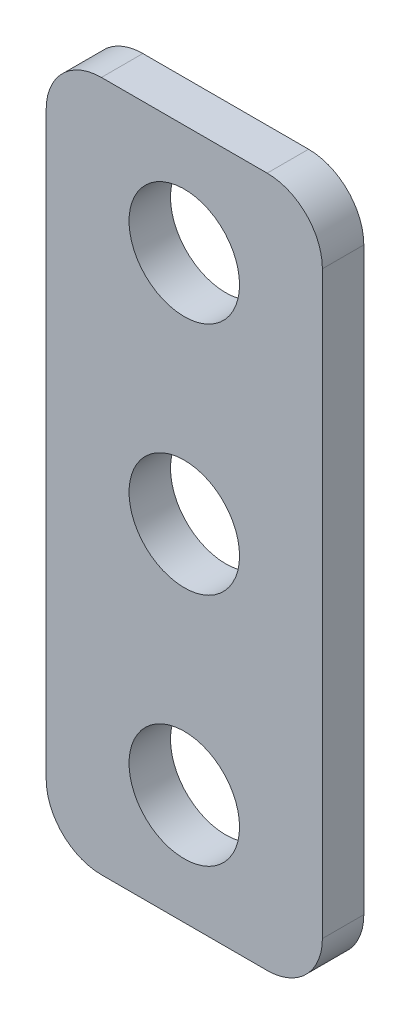
ISO-10303-21;
HEADER;
FILE_DESCRIPTION(('STEP AP214'),'2;1');
FILE_NAME('part.step','',(''),(''),'','','');
FILE_SCHEMA(('AUTOMOTIVE_DESIGN { 1 0 10303 214 1 1 1 1 }'));
ENDSEC;
DATA;
#1=APPLICATION_CONTEXT('core data for automotive mechanical design processes');
#2=APPLICATION_PROTOCOL_DEFINITION('international standard','automotive_design',2000,#1);
#3=PRODUCT_CONTEXT('',#1,'mechanical');
#4=PRODUCT('Part','Part','',(#3));
#5=PRODUCT_RELATED_PRODUCT_CATEGORY('part','',(#4));
#6=PRODUCT_DEFINITION_FORMATION('','',#4);
#7=PRODUCT_DEFINITION_CONTEXT('part definition',#1,'design');
#8=PRODUCT_DEFINITION('design','',#6,#7);
#9=PRODUCT_DEFINITION_SHAPE('','',#8);
#10=(LENGTH_UNIT() NAMED_UNIT(*) SI_UNIT(.MILLI.,.METRE.));
#11=(NAMED_UNIT(*) PLANE_ANGLE_UNIT() SI_UNIT($,.RADIAN.));
#12=(NAMED_UNIT(*) SI_UNIT($,.STERADIAN.) SOLID_ANGLE_UNIT());
#13=UNCERTAINTY_MEASURE_WITH_UNIT(LENGTH_MEASURE(1.E-05),#10,'distance_accuracy_value','');
#14=(GEOMETRIC_REPRESENTATION_CONTEXT(3) GLOBAL_UNCERTAINTY_ASSIGNED_CONTEXT((#13)) GLOBAL_UNIT_ASSIGNED_CONTEXT((#10,
#11,#12)) REPRESENTATION_CONTEXT('',''));
#15=CARTESIAN_POINT('',(0.,0.,0.));
#16=DIRECTION('',(0.,0.,1.));
#17=DIRECTION('',(1.,0.,0.));
#18=AXIS2_PLACEMENT_3D('',#15,#16,#17);
#19=CARTESIAN_POINT('',(9.99999999999999,-25.,-3.));
#20=DIRECTION('',(1.,0.,0.));
#21=DIRECTION('',(0.,0.,-1.));
#22=AXIS2_PLACEMENT_3D('',#19,#20,#21);
#23=PLANE('',#22);
#24=DIRECTION('',(0.,1.,0.));
#25=VECTOR('',#24,1.);
#26=CARTESIAN_POINT('',(9.99999999999999,-25.,0.));
#27=LINE('',#26,#25);
#28=CARTESIAN_POINT('',(9.99999999999999,-21.,0.));
#29=VERTEX_POINT('',#28);
#30=CARTESIAN_POINT('',(9.99999999999999,21.,0.));
#31=VERTEX_POINT('',#30);
#32=EDGE_CURVE('E167',#29,#31,#27,.T.);
#33=ORIENTED_EDGE('',*,*,#32,.F.);
#34=DIRECTION('',(0.,0.,1.));
#35=VECTOR('',#34,1.);
#36=CARTESIAN_POINT('',(9.99999999999999,-21.,-3.));
#37=LINE('',#36,#35);
#38=CARTESIAN_POINT('',(9.99999999999999,-21.,-3.));
#39=VERTEX_POINT('',#38);
#40=EDGE_CURVE('E147',#29,#39,#37,.F.);
#41=ORIENTED_EDGE('',*,*,#40,.T.);
#42=DIRECTION('',(0.,1.,0.));
#43=VECTOR('',#42,1.);
#44=CARTESIAN_POINT('',(9.99999999999999,-25.,-3.));
#45=LINE('',#44,#43);
#46=CARTESIAN_POINT('',(9.99999999999999,21.,-3.));
#47=VERTEX_POINT('',#46);
#48=EDGE_CURVE('E128',#39,#47,#45,.T.);
#49=ORIENTED_EDGE('',*,*,#48,.T.);
#50=DIRECTION('',(0.,0.,1.));
#51=VECTOR('',#50,1.);
#52=CARTESIAN_POINT('',(9.99999999999999,21.,-3.));
#53=LINE('',#52,#51);
#54=EDGE_CURVE('E144',#47,#31,#53,.T.);
#55=ORIENTED_EDGE('',*,*,#54,.T.);
#56=EDGE_LOOP('',(#33,#41,#49,#55));
#57=FACE_BOUND('',#56,.T.);
#58=ADVANCED_FACE('F41',(#57),#23,.T.);
#59=CARTESIAN_POINT('',(-10.,-25.,-3.));
#60=DIRECTION('',(0.,-1.,0.));
#61=DIRECTION('',(0.,0.,-1.));
#62=AXIS2_PLACEMENT_3D('',#59,#60,#61);
#63=PLANE('',#62);
#64=DIRECTION('',(1.,0.,0.));
#65=VECTOR('',#64,1.);
#66=CARTESIAN_POINT('',(-10.,-25.,-3.));
#67=LINE('',#66,#65);
#68=CARTESIAN_POINT('',(-6.00000000000001,-25.,-3.));
#69=VERTEX_POINT('',#68);
#70=CARTESIAN_POINT('',(5.99999999999999,-25.,-3.));
#71=VERTEX_POINT('',#70);
#72=EDGE_CURVE('E133',#69,#71,#67,.T.);
#73=ORIENTED_EDGE('',*,*,#72,.T.);
#74=DIRECTION('',(0.,0.,1.));
#75=VECTOR('',#74,1.);
#76=CARTESIAN_POINT('',(5.99999999999999,-25.,-3.));
#77=LINE('',#76,#75);
#78=CARTESIAN_POINT('',(5.99999999999999,-25.,0.));
#79=VERTEX_POINT('',#78);
#80=EDGE_CURVE('E127',#71,#79,#77,.T.);
#81=ORIENTED_EDGE('',*,*,#80,.T.);
#82=DIRECTION('',(1.,0.,0.));
#83=VECTOR('',#82,1.);
#84=CARTESIAN_POINT('',(-10.,-25.,0.));
#85=LINE('',#84,#83);
#86=CARTESIAN_POINT('',(-6.00000000000001,-25.,0.));
#87=VERTEX_POINT('',#86);
#88=EDGE_CURVE('E110',#87,#79,#85,.T.);
#89=ORIENTED_EDGE('',*,*,#88,.F.);
#90=DIRECTION('',(0.,0.,1.));
#91=VECTOR('',#90,1.);
#92=CARTESIAN_POINT('',(-6.00000000000001,-25.,-3.));
#93=LINE('',#92,#91);
#94=EDGE_CURVE('E124',#87,#69,#93,.F.);
#95=ORIENTED_EDGE('',*,*,#94,.T.);
#96=EDGE_LOOP('',(#73,#81,#89,#95));
#97=FACE_BOUND('',#96,.T.);
#98=ADVANCED_FACE('F123',(#97),#63,.T.);
#99=CARTESIAN_POINT('',(-10.,-25.,-3.));
#100=DIRECTION('',(-1.,0.,0.));
#101=DIRECTION('',(0.,0.,1.));
#102=AXIS2_PLACEMENT_3D('',#99,#100,#101);
#103=PLANE('',#102);
#104=DIRECTION('',(0.,-1.,0.));
#105=VECTOR('',#104,1.);
#106=CARTESIAN_POINT('',(-10.,-25.,-3.));
#107=LINE('',#106,#105);
#108=CARTESIAN_POINT('',(-10.,21.,-3.));
#109=VERTEX_POINT('',#108);
#110=CARTESIAN_POINT('',(-10.,-21.,-3.));
#111=VERTEX_POINT('',#110);
#112=EDGE_CURVE('E137',#109,#111,#107,.T.);
#113=ORIENTED_EDGE('',*,*,#112,.T.);
#114=DIRECTION('',(0.,0.,1.));
#115=VECTOR('',#114,1.);
#116=CARTESIAN_POINT('',(-10.,-21.,-3.));
#117=LINE('',#116,#115);
#118=CARTESIAN_POINT('',(-10.,-21.,0.));
#119=VERTEX_POINT('',#118);
#120=EDGE_CURVE('E157',#111,#119,#117,.T.);
#121=ORIENTED_EDGE('',*,*,#120,.T.);
#122=DIRECTION('',(0.,-1.,0.));
#123=VECTOR('',#122,1.);
#124=CARTESIAN_POINT('',(-10.,-25.,0.));
#125=LINE('',#124,#123);
#126=CARTESIAN_POINT('',(-10.,21.,0.));
#127=VERTEX_POINT('',#126);
#128=EDGE_CURVE('E112',#127,#119,#125,.T.);
#129=ORIENTED_EDGE('',*,*,#128,.F.);
#130=DIRECTION('',(0.,0.,1.));
#131=VECTOR('',#130,1.);
#132=CARTESIAN_POINT('',(-10.,21.,-3.));
#133=LINE('',#132,#131);
#134=EDGE_CURVE('E155',#127,#109,#133,.F.);
#135=ORIENTED_EDGE('',*,*,#134,.T.);
#136=EDGE_LOOP('',(#113,#121,#129,#135));
#137=FACE_BOUND('',#136,.T.);
#138=ADVANCED_FACE('F160',(#137),#103,.T.);
#139=CARTESIAN_POINT('',(-10.,25.,-3.));
#140=DIRECTION('',(0.,1.,0.));
#141=DIRECTION('',(0.,0.,1.));
#142=AXIS2_PLACEMENT_3D('',#139,#140,#141);
#143=PLANE('',#142);
#144=DIRECTION('',(-1.,0.,0.));
#145=VECTOR('',#144,1.);
#146=CARTESIAN_POINT('',(-10.,25.,-3.));
#147=LINE('',#146,#145);
#148=CARTESIAN_POINT('',(5.99999999999999,25.,-3.));
#149=VERTEX_POINT('',#148);
#150=CARTESIAN_POINT('',(-6.00000000000001,25.,-3.));
#151=VERTEX_POINT('',#150);
#152=EDGE_CURVE('E162',#149,#151,#147,.T.);
#153=ORIENTED_EDGE('',*,*,#152,.T.);
#154=DIRECTION('',(0.,0.,1.));
#155=VECTOR('',#154,1.);
#156=CARTESIAN_POINT('',(-6.00000000000001,25.,-3.));
#157=LINE('',#156,#155);
#158=CARTESIAN_POINT('',(-6.00000000000001,25.,0.));
#159=VERTEX_POINT('',#158);
#160=EDGE_CURVE('E11',#151,#159,#157,.T.);
#161=ORIENTED_EDGE('',*,*,#160,.T.);
#162=DIRECTION('',(-1.,0.,0.));
#163=VECTOR('',#162,1.);
#164=CARTESIAN_POINT('',(-10.,25.,0.));
#165=LINE('',#164,#163);
#166=CARTESIAN_POINT('',(5.99999999999999,25.,0.));
#167=VERTEX_POINT('',#166);
#168=EDGE_CURVE('E170',#167,#159,#165,.T.);
#169=ORIENTED_EDGE('',*,*,#168,.F.);
#170=DIRECTION('',(0.,0.,1.));
#171=VECTOR('',#170,1.);
#172=CARTESIAN_POINT('',(5.99999999999999,25.,-3.));
#173=LINE('',#172,#171);
#174=EDGE_CURVE('E49',#167,#149,#173,.F.);
#175=ORIENTED_EDGE('',*,*,#174,.T.);
#176=EDGE_LOOP('',(#153,#161,#169,#175));
#177=FACE_BOUND('',#176,.T.);
#178=ADVANCED_FACE('F173',(#177),#143,.T.);
#179=CARTESIAN_POINT('',(0.,0.,-3.));
#180=DIRECTION('',(0.,0.,-1.));
#181=DIRECTION('',(-1.,0.,0.));
#182=AXIS2_PLACEMENT_3D('',#179,#180,#181);
#183=PLANE('',#182);
#184=CARTESIAN_POINT('',(0.,17.,-3.));
#185=DIRECTION('',(0.,0.,-1.));
#186=DIRECTION('',(-1.,0.,0.));
#187=AXIS2_PLACEMENT_3D('',#184,#185,#186);
#188=CIRCLE('',#187,4.);
#189=CARTESIAN_POINT('',(-4.,17.,-3.));
#190=VERTEX_POINT('',#189);
#191=EDGE_CURVE('E171',#190,#190,#188,.T.);
#192=ORIENTED_EDGE('',*,*,#191,.F.);
#193=EDGE_LOOP('',(#192));
#194=FACE_BOUND('',#193,.T.);
#195=CARTESIAN_POINT('',(0.,0.,-3.));
#196=DIRECTION('',(0.,0.,-1.));
#197=DIRECTION('',(-1.,0.,0.));
#198=AXIS2_PLACEMENT_3D('',#195,#196,#197);
#199=CIRCLE('',#198,4.);
#200=CARTESIAN_POINT('',(-4.,0.,-3.));
#201=VERTEX_POINT('',#200);
#202=EDGE_CURVE('E188',#201,#201,#199,.T.);
#203=ORIENTED_EDGE('',*,*,#202,.F.);
#204=EDGE_LOOP('',(#203));
#205=FACE_BOUND('',#204,.T.);
#206=CARTESIAN_POINT('',(0.,-17.,-3.));
#207=DIRECTION('',(0.,0.,-1.));
#208=DIRECTION('',(-1.,0.,0.));
#209=AXIS2_PLACEMENT_3D('',#206,#207,#208);
#210=CIRCLE('',#209,4.);
#211=CARTESIAN_POINT('',(-4.,-17.,-3.));
#212=VERTEX_POINT('',#211);
#213=EDGE_CURVE('E191',#212,#212,#210,.T.);
#214=ORIENTED_EDGE('',*,*,#213,.F.);
#215=EDGE_LOOP('',(#214));
#216=FACE_BOUND('',#215,.T.);
#217=ORIENTED_EDGE('',*,*,#48,.F.);
#218=CARTESIAN_POINT('',(5.99999999999999,-21.,-3.));
#219=DIRECTION('',(0.,0.,-1.));
#220=DIRECTION('',(-1.,0.,0.));
#221=AXIS2_PLACEMENT_3D('',#218,#219,#220);
#222=CIRCLE('',#221,4.);
#223=EDGE_CURVE('E153',#39,#71,#222,.T.);
#224=ORIENTED_EDGE('',*,*,#223,.T.);
#225=ORIENTED_EDGE('',*,*,#72,.F.);
#226=CARTESIAN_POINT('',(-6.00000000000001,-21.,-3.));
#227=DIRECTION('',(0.,0.,-1.));
#228=DIRECTION('',(-1.,0.,0.));
#229=AXIS2_PLACEMENT_3D('',#226,#227,#228);
#230=CIRCLE('',#229,4.);
#231=EDGE_CURVE('E132',#69,#111,#230,.T.);
#232=ORIENTED_EDGE('',*,*,#231,.T.);
#233=ORIENTED_EDGE('',*,*,#112,.F.);
#234=CARTESIAN_POINT('',(-6.00000000000001,21.,-3.));
#235=DIRECTION('',(0.,0.,-1.));
#236=DIRECTION('',(-1.,0.,0.));
#237=AXIS2_PLACEMENT_3D('',#234,#235,#236);
#238=CIRCLE('',#237,4.);
#239=EDGE_CURVE('E56',#109,#151,#238,.T.);
#240=ORIENTED_EDGE('',*,*,#239,.T.);
#241=ORIENTED_EDGE('',*,*,#152,.F.);
#242=CARTESIAN_POINT('',(5.99999999999999,21.,-3.));
#243=DIRECTION('',(0.,0.,-1.));
#244=DIRECTION('',(-1.,0.,0.));
#245=AXIS2_PLACEMENT_3D('',#242,#243,#244);
#246=CIRCLE('',#245,4.);
#247=EDGE_CURVE('E149',#149,#47,#246,.T.);
#248=ORIENTED_EDGE('',*,*,#247,.T.);
#249=EDGE_LOOP('',(#217,#224,#225,#232,#233,#240,#241,#248));
#250=FACE_BOUND('',#249,.T.);
#251=ADVANCED_FACE('F180',(#194,#205,#216,#250),#183,.T.);
#252=CARTESIAN_POINT('',(0.,0.,0.));
#253=DIRECTION('',(0.,0.,-1.));
#254=DIRECTION('',(-1.,0.,0.));
#255=AXIS2_PLACEMENT_3D('',#252,#253,#254);
#256=PLANE('',#255);
#257=CARTESIAN_POINT('',(0.,17.,0.));
#258=DIRECTION('',(0.,0.,1.));
#259=DIRECTION('',(1.,0.,0.));
#260=AXIS2_PLACEMENT_3D('',#257,#258,#259);
#261=CIRCLE('',#260,4.);
#262=CARTESIAN_POINT('',(4.,17.,0.));
#263=VERTEX_POINT('',#262);
#264=EDGE_CURVE('E194',#263,#263,#261,.T.);
#265=ORIENTED_EDGE('',*,*,#264,.F.);
#266=EDGE_LOOP('',(#265));
#267=FACE_BOUND('',#266,.T.);
#268=CARTESIAN_POINT('',(0.,0.,0.));
#269=DIRECTION('',(0.,0.,1.));
#270=DIRECTION('',(1.,0.,0.));
#271=AXIS2_PLACEMENT_3D('',#268,#269,#270);
#272=CIRCLE('',#271,4.);
#273=CARTESIAN_POINT('',(4.,0.,0.));
#274=VERTEX_POINT('',#273);
#275=EDGE_CURVE('E198',#274,#274,#272,.T.);
#276=ORIENTED_EDGE('',*,*,#275,.F.);
#277=EDGE_LOOP('',(#276));
#278=FACE_BOUND('',#277,.T.);
#279=CARTESIAN_POINT('',(0.,-17.,0.));
#280=DIRECTION('',(0.,0.,1.));
#281=DIRECTION('',(1.,0.,0.));
#282=AXIS2_PLACEMENT_3D('',#279,#280,#281);
#283=CIRCLE('',#282,4.);
#284=CARTESIAN_POINT('',(4.,-17.,0.));
#285=VERTEX_POINT('',#284);
#286=EDGE_CURVE('E195',#285,#285,#283,.T.);
#287=ORIENTED_EDGE('',*,*,#286,.F.);
#288=EDGE_LOOP('',(#287));
#289=FACE_BOUND('',#288,.T.);
#290=ORIENTED_EDGE('',*,*,#88,.T.);
#291=CARTESIAN_POINT('',(5.99999999999999,-21.,0.));
#292=DIRECTION('',(0.,0.,-1.));
#293=DIRECTION('',(-1.,0.,0.));
#294=AXIS2_PLACEMENT_3D('',#291,#292,#293);
#295=CIRCLE('',#294,4.);
#296=EDGE_CURVE('E117',#79,#29,#295,.F.);
#297=ORIENTED_EDGE('',*,*,#296,.T.);
#298=ORIENTED_EDGE('',*,*,#32,.T.);
#299=CARTESIAN_POINT('',(5.99999999999999,21.,0.));
#300=DIRECTION('',(0.,0.,-1.));
#301=DIRECTION('',(-1.,0.,0.));
#302=AXIS2_PLACEMENT_3D('',#299,#300,#301);
#303=CIRCLE('',#302,4.);
#304=EDGE_CURVE('E135',#31,#167,#303,.F.);
#305=ORIENTED_EDGE('',*,*,#304,.T.);
#306=ORIENTED_EDGE('',*,*,#168,.T.);
#307=CARTESIAN_POINT('',(-6.00000000000001,21.,0.));
#308=DIRECTION('',(0.,0.,-1.));
#309=DIRECTION('',(-1.,0.,0.));
#310=AXIS2_PLACEMENT_3D('',#307,#308,#309);
#311=CIRCLE('',#310,4.);
#312=EDGE_CURVE('E118',#159,#127,#311,.F.);
#313=ORIENTED_EDGE('',*,*,#312,.T.);
#314=ORIENTED_EDGE('',*,*,#128,.T.);
#315=CARTESIAN_POINT('',(-6.00000000000001,-21.,0.));
#316=DIRECTION('',(0.,0.,-1.));
#317=DIRECTION('',(-1.,0.,0.));
#318=AXIS2_PLACEMENT_3D('',#315,#316,#317);
#319=CIRCLE('',#318,4.);
#320=EDGE_CURVE('E107',#119,#87,#319,.F.);
#321=ORIENTED_EDGE('',*,*,#320,.T.);
#322=EDGE_LOOP('',(#290,#297,#298,#305,#306,#313,#314,#321));
#323=FACE_BOUND('',#322,.T.);
#324=ADVANCED_FACE('F109',(#267,#278,#289,#323),#256,.F.);
#325=CARTESIAN_POINT('',(0.,-17.,-10.));
#326=DIRECTION('',(0.,0.,1.));
#327=DIRECTION('',(1.,0.,0.));
#328=AXIS2_PLACEMENT_3D('',#325,#326,#327);
#329=CYLINDRICAL_SURFACE('',#328,4.);
#330=ORIENTED_EDGE('',*,*,#213,.T.);
#331=EDGE_LOOP('',(#330));
#332=FACE_BOUND('',#331,.T.);
#333=ORIENTED_EDGE('',*,*,#286,.T.);
#334=EDGE_LOOP('',(#333));
#335=FACE_BOUND('',#334,.T.);
#336=ADVANCED_FACE('F208',(#332,#335),#329,.F.);
#337=CARTESIAN_POINT('',(0.,0.,-10.));
#338=DIRECTION('',(0.,0.,1.));
#339=DIRECTION('',(1.,0.,0.));
#340=AXIS2_PLACEMENT_3D('',#337,#338,#339);
#341=CYLINDRICAL_SURFACE('',#340,4.);
#342=ORIENTED_EDGE('',*,*,#202,.T.);
#343=EDGE_LOOP('',(#342));
#344=FACE_BOUND('',#343,.T.);
#345=ORIENTED_EDGE('',*,*,#275,.T.);
#346=EDGE_LOOP('',(#345));
#347=FACE_BOUND('',#346,.T.);
#348=ADVANCED_FACE('F215',(#344,#347),#341,.F.);
#349=CARTESIAN_POINT('',(0.,17.,-10.));
#350=DIRECTION('',(0.,0.,1.));
#351=DIRECTION('',(1.,0.,0.));
#352=AXIS2_PLACEMENT_3D('',#349,#350,#351);
#353=CYLINDRICAL_SURFACE('',#352,4.);
#354=ORIENTED_EDGE('',*,*,#191,.T.);
#355=EDGE_LOOP('',(#354));
#356=FACE_BOUND('',#355,.T.);
#357=ORIENTED_EDGE('',*,*,#264,.T.);
#358=EDGE_LOOP('',(#357));
#359=FACE_BOUND('',#358,.T.);
#360=ADVANCED_FACE('F204',(#356,#359),#353,.F.);
#361=CARTESIAN_POINT('',(5.99999999999999,-21.,-3.));
#362=DIRECTION('',(0.,0.,1.));
#363=DIRECTION('',(1.,0.,0.));
#364=AXIS2_PLACEMENT_3D('',#361,#362,#363);
#365=CYLINDRICAL_SURFACE('',#364,4.);
#366=ORIENTED_EDGE('',*,*,#223,.F.);
#367=ORIENTED_EDGE('',*,*,#40,.F.);
#368=ORIENTED_EDGE('',*,*,#296,.F.);
#369=ORIENTED_EDGE('',*,*,#80,.F.);
#370=EDGE_LOOP('',(#366,#367,#368,#369));
#371=FACE_BOUND('',#370,.T.);
#372=ADVANCED_FACE('F233',(#371),#365,.T.);
#373=CARTESIAN_POINT('',(-6.00000000000001,-21.,-3.));
#374=DIRECTION('',(0.,0.,1.));
#375=DIRECTION('',(1.,0.,0.));
#376=AXIS2_PLACEMENT_3D('',#373,#374,#375);
#377=CYLINDRICAL_SURFACE('',#376,4.);
#378=ORIENTED_EDGE('',*,*,#231,.F.);
#379=ORIENTED_EDGE('',*,*,#94,.F.);
#380=ORIENTED_EDGE('',*,*,#320,.F.);
#381=ORIENTED_EDGE('',*,*,#120,.F.);
#382=EDGE_LOOP('',(#378,#379,#380,#381));
#383=FACE_BOUND('',#382,.T.);
#384=ADVANCED_FACE('F131',(#383),#377,.T.);
#385=CARTESIAN_POINT('',(-6.00000000000001,21.,-3.));
#386=DIRECTION('',(0.,0.,1.));
#387=DIRECTION('',(1.,0.,0.));
#388=AXIS2_PLACEMENT_3D('',#385,#386,#387);
#389=CYLINDRICAL_SURFACE('',#388,4.);
#390=ORIENTED_EDGE('',*,*,#239,.F.);
#391=ORIENTED_EDGE('',*,*,#134,.F.);
#392=ORIENTED_EDGE('',*,*,#312,.F.);
#393=ORIENTED_EDGE('',*,*,#160,.F.);
#394=EDGE_LOOP('',(#390,#391,#392,#393));
#395=FACE_BOUND('',#394,.T.);
#396=ADVANCED_FACE('F238',(#395),#389,.T.);
#397=CARTESIAN_POINT('',(5.99999999999999,21.,-3.));
#398=DIRECTION('',(0.,0.,1.));
#399=DIRECTION('',(1.,0.,0.));
#400=AXIS2_PLACEMENT_3D('',#397,#398,#399);
#401=CYLINDRICAL_SURFACE('',#400,4.);
#402=ORIENTED_EDGE('',*,*,#247,.F.);
#403=ORIENTED_EDGE('',*,*,#174,.F.);
#404=ORIENTED_EDGE('',*,*,#304,.F.);
#405=ORIENTED_EDGE('',*,*,#54,.F.);
#406=EDGE_LOOP('',(#402,#403,#404,#405));
#407=FACE_BOUND('',#406,.T.);
#408=ADVANCED_FACE('F43',(#407),#401,.T.);
#409=CLOSED_SHELL('',(#58,#98,#138,#178,#251,#324,#336,#348,#360,#372,#384,#396,#408));
#410=MANIFOLD_SOLID_BREP('B2',#409);
#411=ADVANCED_BREP_SHAPE_REPRESENTATION('',(#18,#410),#14);
#412=SHAPE_DEFINITION_REPRESENTATION(#9,#411);
ENDSEC;
END-ISO-10303-21;
